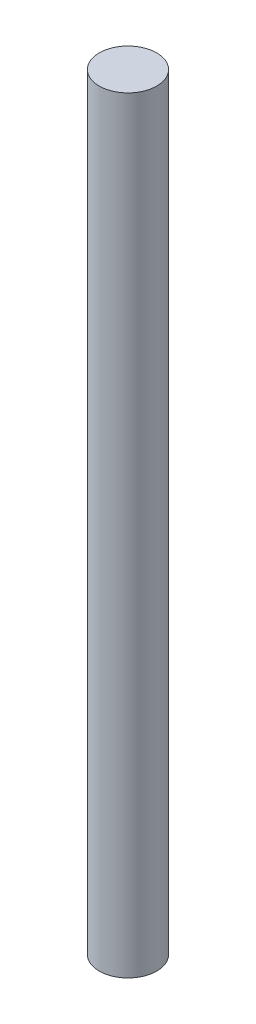
ISO-10303-21;
HEADER;
FILE_DESCRIPTION(('STEP AP214'),'2;1');
FILE_NAME('part.step','',(''),(''),'','','');
FILE_SCHEMA(('AUTOMOTIVE_DESIGN { 1 0 10303 214 1 1 1 1 }'));
ENDSEC;
DATA;
#1=APPLICATION_CONTEXT('core data for automotive mechanical design processes');
#2=APPLICATION_PROTOCOL_DEFINITION('international standard','automotive_design',2000,#1);
#3=PRODUCT_CONTEXT('',#1,'mechanical');
#4=PRODUCT('Part','Part','',(#3));
#5=PRODUCT_RELATED_PRODUCT_CATEGORY('part','',(#4));
#6=PRODUCT_DEFINITION_FORMATION('','',#4);
#7=PRODUCT_DEFINITION_CONTEXT('part definition',#1,'design');
#8=PRODUCT_DEFINITION('design','',#6,#7);
#9=PRODUCT_DEFINITION_SHAPE('','',#8);
#10=(LENGTH_UNIT() NAMED_UNIT(*) SI_UNIT(.MILLI.,.METRE.));
#11=(NAMED_UNIT(*) PLANE_ANGLE_UNIT() SI_UNIT($,.RADIAN.));
#12=(NAMED_UNIT(*) SI_UNIT($,.STERADIAN.) SOLID_ANGLE_UNIT());
#13=UNCERTAINTY_MEASURE_WITH_UNIT(LENGTH_MEASURE(1.E-05),#10,'distance_accuracy_value','');
#14=(GEOMETRIC_REPRESENTATION_CONTEXT(3) GLOBAL_UNCERTAINTY_ASSIGNED_CONTEXT((#13)) GLOBAL_UNIT_ASSIGNED_CONTEXT((#10,
#11,#12)) REPRESENTATION_CONTEXT('',''));
#15=CARTESIAN_POINT('',(0.,0.,0.));
#16=DIRECTION('',(0.,0.,1.));
#17=DIRECTION('',(1.,0.,0.));
#18=AXIS2_PLACEMENT_3D('',#15,#16,#17);
#19=CARTESIAN_POINT('',(0.,160.,0.));
#20=DIRECTION('',(0.,-1.,0.));
#21=DIRECTION('',(0.,0.,-1.));
#22=AXIS2_PLACEMENT_3D('',#19,#20,#21);
#23=CYLINDRICAL_SURFACE('',#22,6.);
#24=CARTESIAN_POINT('',(0.,160.,0.));
#25=DIRECTION('',(0.,1.,0.));
#26=DIRECTION('',(0.,0.,1.));
#27=AXIS2_PLACEMENT_3D('',#24,#25,#26);
#28=CIRCLE('',#27,6.);
#29=CARTESIAN_POINT('',(0.,160.,6.));
#30=VERTEX_POINT('',#29);
#31=EDGE_CURVE('E10',#30,#30,#28,.T.);
#32=ORIENTED_EDGE('',*,*,#31,.F.);
#33=EDGE_LOOP('',(#32));
#34=FACE_BOUND('',#33,.T.);
#35=CARTESIAN_POINT('',(0.,0.,0.));
#36=DIRECTION('',(0.,1.,0.));
#37=DIRECTION('',(0.,0.,1.));
#38=AXIS2_PLACEMENT_3D('',#35,#36,#37);
#39=CIRCLE('',#38,6.);
#40=CARTESIAN_POINT('',(0.,0.,6.));
#41=VERTEX_POINT('',#40);
#42=EDGE_CURVE('E40',#41,#41,#39,.T.);
#43=ORIENTED_EDGE('',*,*,#42,.T.);
#44=EDGE_LOOP('',(#43));
#45=FACE_BOUND('',#44,.T.);
#46=ADVANCED_FACE('F37',(#34,#45),#23,.T.);
#47=CARTESIAN_POINT('',(0.,160.,0.));
#48=DIRECTION('',(0.,1.,0.));
#49=DIRECTION('',(0.,0.,1.));
#50=AXIS2_PLACEMENT_3D('',#47,#48,#49);
#51=PLANE('',#50);
#52=ORIENTED_EDGE('',*,*,#31,.T.);
#53=EDGE_LOOP('',(#52));
#54=FACE_BOUND('',#53,.T.);
#55=ADVANCED_FACE('F54',(#54),#51,.T.);
#56=CARTESIAN_POINT('',(0.,0.,0.));
#57=DIRECTION('',(0.,1.,0.));
#58=DIRECTION('',(0.,0.,1.));
#59=AXIS2_PLACEMENT_3D('',#56,#57,#58);
#60=PLANE('',#59);
#61=ORIENTED_EDGE('',*,*,#42,.F.);
#62=EDGE_LOOP('',(#61));
#63=FACE_BOUND('',#62,.T.);
#64=ADVANCED_FACE('F52',(#63),#60,.F.);
#65=CLOSED_SHELL('',(#46,#55,#64));
#66=MANIFOLD_SOLID_BREP('B2',#65);
#67=ADVANCED_BREP_SHAPE_REPRESENTATION('',(#18,#66),#14);
#68=SHAPE_DEFINITION_REPRESENTATION(#9,#67);
ENDSEC;
END-ISO-10303-21;
